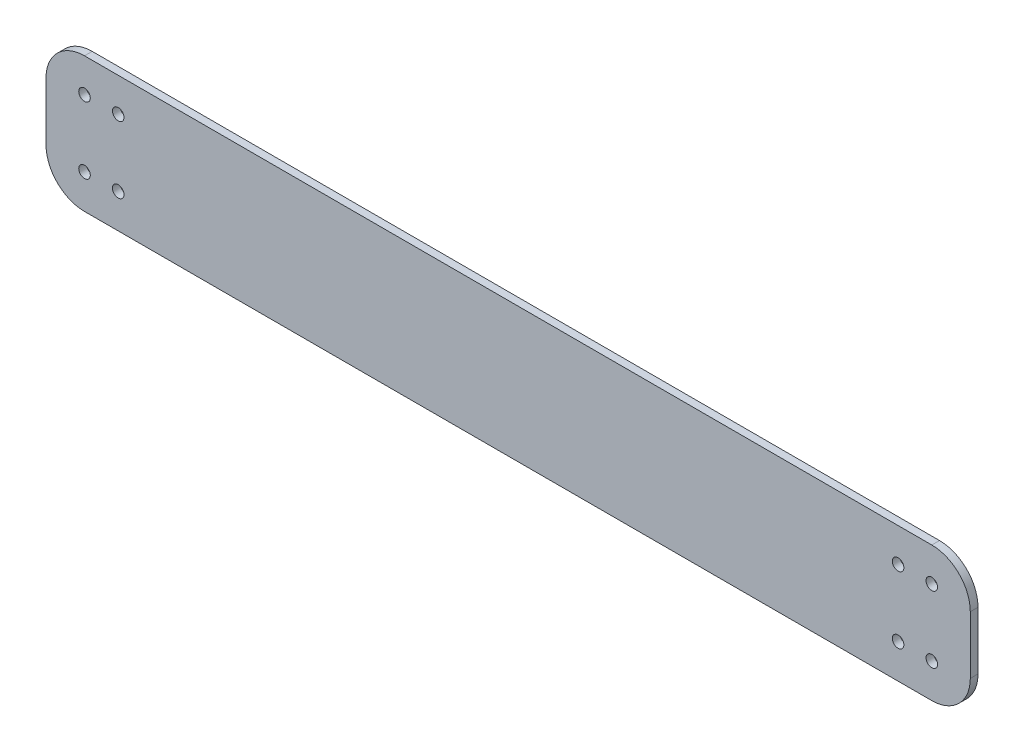
ISO-10303-21;
HEADER;
FILE_DESCRIPTION(('STEP AP214'),'2;1');
FILE_NAME('part.step','',(''),(''),'','','');
FILE_SCHEMA(('AUTOMOTIVE_DESIGN { 1 0 10303 214 1 1 1 1 }'));
ENDSEC;
DATA;
#1=APPLICATION_CONTEXT('core data for automotive mechanical design processes');
#2=APPLICATION_PROTOCOL_DEFINITION('international standard','automotive_design',2000,#1);
#3=PRODUCT_CONTEXT('',#1,'mechanical');
#4=PRODUCT('Part','Part','',(#3));
#5=PRODUCT_RELATED_PRODUCT_CATEGORY('part','',(#4));
#6=PRODUCT_DEFINITION_FORMATION('','',#4);
#7=PRODUCT_DEFINITION_CONTEXT('part definition',#1,'design');
#8=PRODUCT_DEFINITION('design','',#6,#7);
#9=PRODUCT_DEFINITION_SHAPE('','',#8);
#10=(LENGTH_UNIT() NAMED_UNIT(*) SI_UNIT(.MILLI.,.METRE.));
#11=(NAMED_UNIT(*) PLANE_ANGLE_UNIT() SI_UNIT($,.RADIAN.));
#12=(NAMED_UNIT(*) SI_UNIT($,.STERADIAN.) SOLID_ANGLE_UNIT());
#13=UNCERTAINTY_MEASURE_WITH_UNIT(LENGTH_MEASURE(1.E-05),#10,'distance_accuracy_value','');
#14=(GEOMETRIC_REPRESENTATION_CONTEXT(3) GLOBAL_UNCERTAINTY_ASSIGNED_CONTEXT((#13)) GLOBAL_UNIT_ASSIGNED_CONTEXT((#10,
#11,#12)) REPRESENTATION_CONTEXT('',''));
#15=CARTESIAN_POINT('',(0.,0.,0.));
#16=DIRECTION('',(0.,0.,1.));
#17=DIRECTION('',(1.,0.,0.));
#18=AXIS2_PLACEMENT_3D('',#15,#16,#17);
#19=CARTESIAN_POINT('',(169.639632597225,-2.6296006774803,2.));
#20=DIRECTION('',(0.,0.,-1.));
#21=DIRECTION('',(-1.,0.,0.));
#22=AXIS2_PLACEMENT_3D('',#19,#20,#21);
#23=CYLINDRICAL_SURFACE('',#22,10.);
#24=CARTESIAN_POINT('',(169.639632597225,-2.6296006774803,0.));
#25=DIRECTION('',(0.,0.,1.));
#26=DIRECTION('',(-1.,0.,0.));
#27=AXIS2_PLACEMENT_3D('',#24,#25,#26);
#28=CIRCLE('',#27,10.);
#29=CARTESIAN_POINT('',(169.639632597225,-12.6296006774803,0.));
#30=VERTEX_POINT('',#29);
#31=CARTESIAN_POINT('',(179.639632597225,-2.62960067748023,0.));
#32=VERTEX_POINT('',#31);
#33=EDGE_CURVE('E133',#30,#32,#28,.T.);
#34=ORIENTED_EDGE('',*,*,#33,.T.);
#35=DIRECTION('',(0.,0.,-1.));
#36=VECTOR('',#35,1.);
#37=CARTESIAN_POINT('',(179.639632597225,-2.62960067748023,2.));
#38=LINE('',#37,#36);
#39=CARTESIAN_POINT('',(179.639632597225,-2.62960067748023,2.));
#40=VERTEX_POINT('',#39);
#41=EDGE_CURVE('E11',#40,#32,#38,.T.);
#42=ORIENTED_EDGE('',*,*,#41,.F.);
#43=CARTESIAN_POINT('',(169.639632597225,-2.6296006774803,2.));
#44=DIRECTION('',(0.,0.,1.));
#45=DIRECTION('',(-1.,0.,0.));
#46=AXIS2_PLACEMENT_3D('',#43,#44,#45);
#47=CIRCLE('',#46,10.);
#48=CARTESIAN_POINT('',(169.639632597225,-12.6296006774803,2.));
#49=VERTEX_POINT('',#48);
#50=EDGE_CURVE('E148',#49,#40,#47,.T.);
#51=ORIENTED_EDGE('',*,*,#50,.F.);
#52=DIRECTION('',(0.,0.,-1.));
#53=VECTOR('',#52,1.);
#54=CARTESIAN_POINT('',(169.639632597225,-12.6296006774803,2.));
#55=LINE('',#54,#53);
#56=EDGE_CURVE('E129',#49,#30,#55,.T.);
#57=ORIENTED_EDGE('',*,*,#56,.T.);
#58=EDGE_LOOP('',(#34,#42,#51,#57));
#59=FACE_BOUND('',#58,.T.);
#60=ADVANCED_FACE('F37',(#59),#23,.T.);
#61=CARTESIAN_POINT('',(179.639632597225,12.3703993225196,2.));
#62=DIRECTION('',(-1.,0.,0.));
#63=DIRECTION('',(0.,0.,1.));
#64=AXIS2_PLACEMENT_3D('',#61,#62,#63);
#65=PLANE('',#64);
#66=DIRECTION('',(0.,1.,0.));
#67=VECTOR('',#66,1.);
#68=CARTESIAN_POINT('',(179.639632597225,12.3703993225196,0.));
#69=LINE('',#68,#67);
#70=CARTESIAN_POINT('',(179.639632597225,12.3703993225196,0.));
#71=VERTEX_POINT('',#70);
#72=EDGE_CURVE('E136',#32,#71,#69,.T.);
#73=ORIENTED_EDGE('',*,*,#72,.T.);
#74=DIRECTION('',(0.,0.,-1.));
#75=VECTOR('',#74,1.);
#76=CARTESIAN_POINT('',(179.639632597225,12.3703993225196,2.));
#77=LINE('',#76,#75);
#78=CARTESIAN_POINT('',(179.639632597225,12.3703993225196,2.));
#79=VERTEX_POINT('',#78);
#80=EDGE_CURVE('E45',#79,#71,#77,.T.);
#81=ORIENTED_EDGE('',*,*,#80,.F.);
#82=DIRECTION('',(0.,1.,0.));
#83=VECTOR('',#82,1.);
#84=CARTESIAN_POINT('',(179.639632597225,12.3703993225196,2.));
#85=LINE('',#84,#83);
#86=EDGE_CURVE('E96',#40,#79,#85,.T.);
#87=ORIENTED_EDGE('',*,*,#86,.F.);
#88=ORIENTED_EDGE('',*,*,#41,.T.);
#89=EDGE_LOOP('',(#73,#81,#87,#88));
#90=FACE_BOUND('',#89,.T.);
#91=ADVANCED_FACE('F262',(#90),#65,.F.);
#92=CARTESIAN_POINT('',(169.639632597225,12.3703993225197,2.));
#93=DIRECTION('',(0.,0.,-1.));
#94=DIRECTION('',(-1.,0.,0.));
#95=AXIS2_PLACEMENT_3D('',#92,#93,#94);
#96=CYLINDRICAL_SURFACE('',#95,10.);
#97=CARTESIAN_POINT('',(169.639632597225,12.3703993225197,0.));
#98=DIRECTION('',(0.,0.,1.));
#99=DIRECTION('',(-1.,0.,0.));
#100=AXIS2_PLACEMENT_3D('',#97,#98,#99);
#101=CIRCLE('',#100,10.);
#102=CARTESIAN_POINT('',(169.639632597225,22.3703993225197,0.));
#103=VERTEX_POINT('',#102);
#104=EDGE_CURVE('E139',#71,#103,#101,.T.);
#105=ORIENTED_EDGE('',*,*,#104,.T.);
#106=DIRECTION('',(0.,0.,-1.));
#107=VECTOR('',#106,1.);
#108=CARTESIAN_POINT('',(169.639632597225,22.3703993225197,2.));
#109=LINE('',#108,#107);
#110=CARTESIAN_POINT('',(169.639632597225,22.3703993225197,2.));
#111=VERTEX_POINT('',#110);
#112=EDGE_CURVE('E155',#111,#103,#109,.T.);
#113=ORIENTED_EDGE('',*,*,#112,.F.);
#114=CARTESIAN_POINT('',(169.639632597225,12.3703993225197,2.));
#115=DIRECTION('',(0.,0.,1.));
#116=DIRECTION('',(-1.,0.,0.));
#117=AXIS2_PLACEMENT_3D('',#114,#115,#116);
#118=CIRCLE('',#117,10.);
#119=EDGE_CURVE('E163',#79,#111,#118,.T.);
#120=ORIENTED_EDGE('',*,*,#119,.F.);
#121=ORIENTED_EDGE('',*,*,#80,.T.);
#122=EDGE_LOOP('',(#105,#113,#120,#121));
#123=FACE_BOUND('',#122,.T.);
#124=ADVANCED_FACE('F161',(#123),#96,.T.);
#125=CARTESIAN_POINT('',(-50.360367402775,22.3703993225197,2.));
#126=DIRECTION('',(0.,-1.,0.));
#127=DIRECTION('',(0.,0.,-1.));
#128=AXIS2_PLACEMENT_3D('',#125,#126,#127);
#129=PLANE('',#128);
#130=DIRECTION('',(-1.,0.,0.));
#131=VECTOR('',#130,1.);
#132=CARTESIAN_POINT('',(-50.360367402775,22.3703993225197,0.));
#133=LINE('',#132,#131);
#134=CARTESIAN_POINT('',(-50.360367402775,22.3703993225197,0.));
#135=VERTEX_POINT('',#134);
#136=EDGE_CURVE('E141',#103,#135,#133,.T.);
#137=ORIENTED_EDGE('',*,*,#136,.T.);
#138=DIRECTION('',(0.,0.,-1.));
#139=VECTOR('',#138,1.);
#140=CARTESIAN_POINT('',(-50.360367402775,22.3703993225197,2.));
#141=LINE('',#140,#139);
#142=CARTESIAN_POINT('',(-50.360367402775,22.3703993225197,2.));
#143=VERTEX_POINT('',#142);
#144=EDGE_CURVE('E152',#143,#135,#141,.T.);
#145=ORIENTED_EDGE('',*,*,#144,.F.);
#146=DIRECTION('',(-1.,0.,0.));
#147=VECTOR('',#146,1.);
#148=CARTESIAN_POINT('',(-50.360367402775,22.3703993225197,2.));
#149=LINE('',#148,#147);
#150=EDGE_CURVE('E175',#111,#143,#149,.T.);
#151=ORIENTED_EDGE('',*,*,#150,.F.);
#152=ORIENTED_EDGE('',*,*,#112,.T.);
#153=EDGE_LOOP('',(#137,#145,#151,#152));
#154=FACE_BOUND('',#153,.T.);
#155=ADVANCED_FACE('F171',(#154),#129,.F.);
#156=CARTESIAN_POINT('',(-50.3603674027751,12.3703993225197,2.));
#157=DIRECTION('',(0.,0.,-1.));
#158=DIRECTION('',(-1.,0.,0.));
#159=AXIS2_PLACEMENT_3D('',#156,#157,#158);
#160=CYLINDRICAL_SURFACE('',#159,10.);
#161=CARTESIAN_POINT('',(-50.3603674027751,12.3703993225197,0.));
#162=DIRECTION('',(0.,0.,1.));
#163=DIRECTION('',(1.,0.,0.));
#164=AXIS2_PLACEMENT_3D('',#161,#162,#163);
#165=CIRCLE('',#164,10.);
#166=CARTESIAN_POINT('',(-60.3603674027751,12.3703993225196,0.));
#167=VERTEX_POINT('',#166);
#168=EDGE_CURVE('E143',#135,#167,#165,.T.);
#169=ORIENTED_EDGE('',*,*,#168,.T.);
#170=DIRECTION('',(0.,0.,-1.));
#171=VECTOR('',#170,1.);
#172=CARTESIAN_POINT('',(-60.3603674027751,12.3703993225196,2.));
#173=LINE('',#172,#171);
#174=CARTESIAN_POINT('',(-60.3603674027751,12.3703993225196,2.));
#175=VERTEX_POINT('',#174);
#176=EDGE_CURVE('E124',#175,#167,#173,.T.);
#177=ORIENTED_EDGE('',*,*,#176,.F.);
#178=CARTESIAN_POINT('',(-50.3603674027751,12.3703993225197,2.));
#179=DIRECTION('',(0.,0.,1.));
#180=DIRECTION('',(1.,0.,0.));
#181=AXIS2_PLACEMENT_3D('',#178,#179,#180);
#182=CIRCLE('',#181,10.);
#183=EDGE_CURVE('E115',#143,#175,#182,.T.);
#184=ORIENTED_EDGE('',*,*,#183,.F.);
#185=ORIENTED_EDGE('',*,*,#144,.T.);
#186=EDGE_LOOP('',(#169,#177,#184,#185));
#187=FACE_BOUND('',#186,.T.);
#188=ADVANCED_FACE('F174',(#187),#160,.T.);
#189=CARTESIAN_POINT('',(-60.3603674027751,-2.62960067748023,2.));
#190=DIRECTION('',(1.,0.,0.));
#191=DIRECTION('',(0.,0.,-1.));
#192=AXIS2_PLACEMENT_3D('',#189,#190,#191);
#193=PLANE('',#192);
#194=DIRECTION('',(0.,-1.,0.));
#195=VECTOR('',#194,1.);
#196=CARTESIAN_POINT('',(-60.3603674027751,-2.62960067748023,0.));
#197=LINE('',#196,#195);
#198=CARTESIAN_POINT('',(-60.3603674027751,-2.62960067748023,0.));
#199=VERTEX_POINT('',#198);
#200=EDGE_CURVE('E123',#167,#199,#197,.T.);
#201=ORIENTED_EDGE('',*,*,#200,.T.);
#202=DIRECTION('',(0.,0.,-1.));
#203=VECTOR('',#202,1.);
#204=CARTESIAN_POINT('',(-60.3603674027751,-2.62960067748023,2.));
#205=LINE('',#204,#203);
#206=CARTESIAN_POINT('',(-60.3603674027751,-2.62960067748023,2.));
#207=VERTEX_POINT('',#206);
#208=EDGE_CURVE('E120',#207,#199,#205,.T.);
#209=ORIENTED_EDGE('',*,*,#208,.F.);
#210=DIRECTION('',(0.,-1.,0.));
#211=VECTOR('',#210,1.);
#212=CARTESIAN_POINT('',(-60.3603674027751,-2.62960067748023,2.));
#213=LINE('',#212,#211);
#214=EDGE_CURVE('E109',#175,#207,#213,.T.);
#215=ORIENTED_EDGE('',*,*,#214,.F.);
#216=ORIENTED_EDGE('',*,*,#176,.T.);
#217=EDGE_LOOP('',(#201,#209,#215,#216));
#218=FACE_BOUND('',#217,.T.);
#219=ADVANCED_FACE('F121',(#218),#193,.F.);
#220=CARTESIAN_POINT('',(-50.3603674027751,-2.6296006774803,2.));
#221=DIRECTION('',(0.,0.,-1.));
#222=DIRECTION('',(-1.,0.,0.));
#223=AXIS2_PLACEMENT_3D('',#220,#221,#222);
#224=CYLINDRICAL_SURFACE('',#223,10.);
#225=CARTESIAN_POINT('',(-50.3603674027751,-2.6296006774803,0.));
#226=DIRECTION('',(0.,0.,1.));
#227=DIRECTION('',(-1.,0.,0.));
#228=AXIS2_PLACEMENT_3D('',#225,#226,#227);
#229=CIRCLE('',#228,10.);
#230=CARTESIAN_POINT('',(-50.360367402775,-12.6296006774803,0.));
#231=VERTEX_POINT('',#230);
#232=EDGE_CURVE('E82',#199,#231,#229,.T.);
#233=ORIENTED_EDGE('',*,*,#232,.T.);
#234=DIRECTION('',(0.,0.,-1.));
#235=VECTOR('',#234,1.);
#236=CARTESIAN_POINT('',(-50.360367402775,-12.6296006774803,2.));
#237=LINE('',#236,#235);
#238=CARTESIAN_POINT('',(-50.360367402775,-12.6296006774803,2.));
#239=VERTEX_POINT('',#238);
#240=EDGE_CURVE('E125',#239,#231,#237,.T.);
#241=ORIENTED_EDGE('',*,*,#240,.F.);
#242=CARTESIAN_POINT('',(-50.3603674027751,-2.6296006774803,2.));
#243=DIRECTION('',(0.,0.,1.));
#244=DIRECTION('',(-1.,0.,0.));
#245=AXIS2_PLACEMENT_3D('',#242,#243,#244);
#246=CIRCLE('',#245,10.);
#247=EDGE_CURVE('E113',#207,#239,#246,.T.);
#248=ORIENTED_EDGE('',*,*,#247,.F.);
#249=ORIENTED_EDGE('',*,*,#208,.T.);
#250=EDGE_LOOP('',(#233,#241,#248,#249));
#251=FACE_BOUND('',#250,.T.);
#252=ADVANCED_FACE('F127',(#251),#224,.T.);
#253=CARTESIAN_POINT('',(169.639632597225,-12.6296006774803,2.));
#254=DIRECTION('',(0.,1.,0.));
#255=DIRECTION('',(0.,0.,1.));
#256=AXIS2_PLACEMENT_3D('',#253,#254,#255);
#257=PLANE('',#256);
#258=DIRECTION('',(1.,0.,0.));
#259=VECTOR('',#258,1.);
#260=CARTESIAN_POINT('',(169.639632597225,-12.6296006774803,0.));
#261=LINE('',#260,#259);
#262=EDGE_CURVE('E88',#231,#30,#261,.T.);
#263=ORIENTED_EDGE('',*,*,#262,.T.);
#264=ORIENTED_EDGE('',*,*,#56,.F.);
#265=DIRECTION('',(1.,0.,0.));
#266=VECTOR('',#265,1.);
#267=CARTESIAN_POINT('',(169.639632597225,-12.6296006774803,2.));
#268=LINE('',#267,#266);
#269=EDGE_CURVE('E53',#239,#49,#268,.T.);
#270=ORIENTED_EDGE('',*,*,#269,.F.);
#271=ORIENTED_EDGE('',*,*,#240,.T.);
#272=EDGE_LOOP('',(#263,#264,#270,#271));
#273=FACE_BOUND('',#272,.T.);
#274=ADVANCED_FACE('F269',(#273),#257,.F.);
#275=CARTESIAN_POINT('',(169.639632597225,-2.6296006774803,2.));
#276=DIRECTION('',(0.,0.,-1.));
#277=DIRECTION('',(-1.,0.,0.));
#278=AXIS2_PLACEMENT_3D('',#275,#276,#277);
#279=PLANE('',#278);
#280=CARTESIAN_POINT('',(169.639632597225,13.6203993225198,2.));
#281=DIRECTION('',(0.,0.,-1.));
#282=DIRECTION('',(-1.,0.,0.));
#283=AXIS2_PLACEMENT_3D('',#280,#281,#282);
#284=CIRCLE('',#283,1.5);
#285=CARTESIAN_POINT('',(168.139632597225,13.6203993225198,2.));
#286=VERTEX_POINT('',#285);
#287=EDGE_CURVE('E222',#286,#286,#284,.T.);
#288=ORIENTED_EDGE('',*,*,#287,.T.);
#289=EDGE_LOOP('',(#288));
#290=FACE_BOUND('',#289,.T.);
#291=CARTESIAN_POINT('',(160.889632597225,13.6203993225198,2.));
#292=DIRECTION('',(0.,0.,-1.));
#293=DIRECTION('',(-1.,0.,0.));
#294=AXIS2_PLACEMENT_3D('',#291,#292,#293);
#295=CIRCLE('',#294,1.5);
#296=CARTESIAN_POINT('',(159.389632597225,13.6203993225198,2.));
#297=VERTEX_POINT('',#296);
#298=EDGE_CURVE('E216',#297,#297,#295,.T.);
#299=ORIENTED_EDGE('',*,*,#298,.T.);
#300=EDGE_LOOP('',(#299));
#301=FACE_BOUND('',#300,.T.);
#302=CARTESIAN_POINT('',(160.889632597225,-3.73217799081896,2.));
#303=DIRECTION('',(0.,0.,-1.));
#304=DIRECTION('',(-1.,0.,0.));
#305=AXIS2_PLACEMENT_3D('',#302,#303,#304);
#306=CIRCLE('',#305,1.5);
#307=CARTESIAN_POINT('',(159.389632597225,-3.73217799081896,2.));
#308=VERTEX_POINT('',#307);
#309=EDGE_CURVE('E210',#308,#308,#306,.T.);
#310=ORIENTED_EDGE('',*,*,#309,.T.);
#311=EDGE_LOOP('',(#310));
#312=FACE_BOUND('',#311,.T.);
#313=CARTESIAN_POINT('',(169.639632597225,-3.73217799081895,2.));
#314=DIRECTION('',(0.,0.,-1.));
#315=DIRECTION('',(-1.,0.,0.));
#316=AXIS2_PLACEMENT_3D('',#313,#314,#315);
#317=CIRCLE('',#316,1.5);
#318=CARTESIAN_POINT('',(168.139632597225,-3.73217799081895,2.));
#319=VERTEX_POINT('',#318);
#320=EDGE_CURVE('E204',#319,#319,#317,.T.);
#321=ORIENTED_EDGE('',*,*,#320,.T.);
#322=EDGE_LOOP('',(#321));
#323=FACE_BOUND('',#322,.T.);
#324=CARTESIAN_POINT('',(-41.610367402775,13.6203993225197,2.));
#325=DIRECTION('',(0.,0.,-1.));
#326=DIRECTION('',(-1.,0.,0.));
#327=AXIS2_PLACEMENT_3D('',#324,#325,#326);
#328=CIRCLE('',#327,1.5);
#329=CARTESIAN_POINT('',(-43.110367402775,13.6203993225197,2.));
#330=VERTEX_POINT('',#329);
#331=EDGE_CURVE('E198',#330,#330,#328,.T.);
#332=ORIENTED_EDGE('',*,*,#331,.T.);
#333=EDGE_LOOP('',(#332));
#334=FACE_BOUND('',#333,.T.);
#335=CARTESIAN_POINT('',(-50.360367402775,13.6203993225197,2.));
#336=DIRECTION('',(0.,0.,-1.));
#337=DIRECTION('',(-1.,0.,0.));
#338=AXIS2_PLACEMENT_3D('',#335,#336,#337);
#339=CIRCLE('',#338,1.5);
#340=CARTESIAN_POINT('',(-51.860367402775,13.6203993225197,2.));
#341=VERTEX_POINT('',#340);
#342=EDGE_CURVE('E192',#341,#341,#339,.T.);
#343=ORIENTED_EDGE('',*,*,#342,.T.);
#344=EDGE_LOOP('',(#343));
#345=FACE_BOUND('',#344,.T.);
#346=CARTESIAN_POINT('',(-41.610367402775,-3.73217799081904,2.));
#347=DIRECTION('',(0.,0.,-1.));
#348=DIRECTION('',(-1.,0.,0.));
#349=AXIS2_PLACEMENT_3D('',#346,#347,#348);
#350=CIRCLE('',#349,1.5);
#351=CARTESIAN_POINT('',(-43.110367402775,-3.73217799081904,2.));
#352=VERTEX_POINT('',#351);
#353=EDGE_CURVE('E186',#352,#352,#350,.T.);
#354=ORIENTED_EDGE('',*,*,#353,.T.);
#355=EDGE_LOOP('',(#354));
#356=FACE_BOUND('',#355,.T.);
#357=CARTESIAN_POINT('',(-50.360367402775,-3.73217799081904,2.));
#358=DIRECTION('',(0.,0.,-1.));
#359=DIRECTION('',(-1.,0.,0.));
#360=AXIS2_PLACEMENT_3D('',#357,#358,#359);
#361=CIRCLE('',#360,1.5);
#362=CARTESIAN_POINT('',(-51.860367402775,-3.73217799081904,2.));
#363=VERTEX_POINT('',#362);
#364=EDGE_CURVE('E137',#363,#363,#361,.T.);
#365=ORIENTED_EDGE('',*,*,#364,.T.);
#366=EDGE_LOOP('',(#365));
#367=FACE_BOUND('',#366,.T.);
#368=ORIENTED_EDGE('',*,*,#50,.T.);
#369=ORIENTED_EDGE('',*,*,#86,.T.);
#370=ORIENTED_EDGE('',*,*,#119,.T.);
#371=ORIENTED_EDGE('',*,*,#150,.T.);
#372=ORIENTED_EDGE('',*,*,#183,.T.);
#373=ORIENTED_EDGE('',*,*,#214,.T.);
#374=ORIENTED_EDGE('',*,*,#247,.T.);
#375=ORIENTED_EDGE('',*,*,#269,.T.);
#376=EDGE_LOOP('',(#368,#369,#370,#371,#372,#373,#374,#375));
#377=FACE_BOUND('',#376,.T.);
#378=ADVANCED_FACE('F111',(#290,#301,#312,#323,#334,#345,#356,#367,#377),#279,.F.);
#379=CARTESIAN_POINT('',(169.639632597225,-2.6296006774803,0.));
#380=DIRECTION('',(0.,0.,-1.));
#381=DIRECTION('',(-1.,0.,0.));
#382=AXIS2_PLACEMENT_3D('',#379,#380,#381);
#383=PLANE('',#382);
#384=CARTESIAN_POINT('',(169.639632597225,13.6203993225198,0.));
#385=DIRECTION('',(0.,0.,-1.));
#386=DIRECTION('',(-1.,0.,0.));
#387=AXIS2_PLACEMENT_3D('',#384,#385,#386);
#388=CIRCLE('',#387,1.5);
#389=CARTESIAN_POINT('',(168.139632597225,13.6203993225198,0.));
#390=VERTEX_POINT('',#389);
#391=EDGE_CURVE('E225',#390,#390,#388,.T.);
#392=ORIENTED_EDGE('',*,*,#391,.F.);
#393=EDGE_LOOP('',(#392));
#394=FACE_BOUND('',#393,.T.);
#395=CARTESIAN_POINT('',(160.889632597225,13.6203993225198,0.));
#396=DIRECTION('',(0.,0.,-1.));
#397=DIRECTION('',(-1.,0.,0.));
#398=AXIS2_PLACEMENT_3D('',#395,#396,#397);
#399=CIRCLE('',#398,1.49999999999997);
#400=CARTESIAN_POINT('',(159.389632597225,13.6203993225198,0.));
#401=VERTEX_POINT('',#400);
#402=EDGE_CURVE('E219',#401,#401,#399,.T.);
#403=ORIENTED_EDGE('',*,*,#402,.F.);
#404=EDGE_LOOP('',(#403));
#405=FACE_BOUND('',#404,.T.);
#406=CARTESIAN_POINT('',(160.889632597225,-3.73217799081896,0.));
#407=DIRECTION('',(0.,0.,-1.));
#408=DIRECTION('',(-1.,0.,0.));
#409=AXIS2_PLACEMENT_3D('',#406,#407,#408);
#410=CIRCLE('',#409,1.5);
#411=CARTESIAN_POINT('',(159.389632597225,-3.73217799081896,0.));
#412=VERTEX_POINT('',#411);
#413=EDGE_CURVE('E213',#412,#412,#410,.T.);
#414=ORIENTED_EDGE('',*,*,#413,.F.);
#415=EDGE_LOOP('',(#414));
#416=FACE_BOUND('',#415,.T.);
#417=CARTESIAN_POINT('',(169.639632597225,-3.73217799081895,0.));
#418=DIRECTION('',(0.,0.,-1.));
#419=DIRECTION('',(-1.,0.,0.));
#420=AXIS2_PLACEMENT_3D('',#417,#418,#419);
#421=CIRCLE('',#420,1.49999999999997);
#422=CARTESIAN_POINT('',(168.139632597225,-3.73217799081895,0.));
#423=VERTEX_POINT('',#422);
#424=EDGE_CURVE('E207',#423,#423,#421,.T.);
#425=ORIENTED_EDGE('',*,*,#424,.F.);
#426=EDGE_LOOP('',(#425));
#427=FACE_BOUND('',#426,.T.);
#428=CARTESIAN_POINT('',(-41.610367402775,13.6203993225197,0.));
#429=DIRECTION('',(0.,0.,-1.));
#430=DIRECTION('',(-1.,0.,0.));
#431=AXIS2_PLACEMENT_3D('',#428,#429,#430);
#432=CIRCLE('',#431,1.5);
#433=CARTESIAN_POINT('',(-43.110367402775,13.6203993225197,0.));
#434=VERTEX_POINT('',#433);
#435=EDGE_CURVE('E201',#434,#434,#432,.T.);
#436=ORIENTED_EDGE('',*,*,#435,.F.);
#437=EDGE_LOOP('',(#436));
#438=FACE_BOUND('',#437,.T.);
#439=CARTESIAN_POINT('',(-50.360367402775,13.6203993225197,0.));
#440=DIRECTION('',(0.,0.,-1.));
#441=DIRECTION('',(-1.,0.,0.));
#442=AXIS2_PLACEMENT_3D('',#439,#440,#441);
#443=CIRCLE('',#442,1.5);
#444=CARTESIAN_POINT('',(-51.860367402775,13.6203993225197,0.));
#445=VERTEX_POINT('',#444);
#446=EDGE_CURVE('E195',#445,#445,#443,.T.);
#447=ORIENTED_EDGE('',*,*,#446,.F.);
#448=EDGE_LOOP('',(#447));
#449=FACE_BOUND('',#448,.T.);
#450=CARTESIAN_POINT('',(-41.610367402775,-3.73217799081904,0.));
#451=DIRECTION('',(0.,0.,-1.));
#452=DIRECTION('',(-1.,0.,0.));
#453=AXIS2_PLACEMENT_3D('',#450,#451,#452);
#454=CIRCLE('',#453,1.5);
#455=CARTESIAN_POINT('',(-43.110367402775,-3.73217799081904,0.));
#456=VERTEX_POINT('',#455);
#457=EDGE_CURVE('E189',#456,#456,#454,.T.);
#458=ORIENTED_EDGE('',*,*,#457,.F.);
#459=EDGE_LOOP('',(#458));
#460=FACE_BOUND('',#459,.T.);
#461=CARTESIAN_POINT('',(-50.360367402775,-3.73217799081904,0.));
#462=DIRECTION('',(0.,0.,-1.));
#463=DIRECTION('',(-1.,0.,0.));
#464=AXIS2_PLACEMENT_3D('',#461,#462,#463);
#465=CIRCLE('',#464,1.5);
#466=CARTESIAN_POINT('',(-51.860367402775,-3.73217799081904,0.));
#467=VERTEX_POINT('',#466);
#468=EDGE_CURVE('E183',#467,#467,#465,.T.);
#469=ORIENTED_EDGE('',*,*,#468,.F.);
#470=EDGE_LOOP('',(#469));
#471=FACE_BOUND('',#470,.T.);
#472=ORIENTED_EDGE('',*,*,#33,.F.);
#473=ORIENTED_EDGE('',*,*,#262,.F.);
#474=ORIENTED_EDGE('',*,*,#232,.F.);
#475=ORIENTED_EDGE('',*,*,#200,.F.);
#476=ORIENTED_EDGE('',*,*,#168,.F.);
#477=ORIENTED_EDGE('',*,*,#136,.F.);
#478=ORIENTED_EDGE('',*,*,#104,.F.);
#479=ORIENTED_EDGE('',*,*,#72,.F.);
#480=EDGE_LOOP('',(#472,#473,#474,#475,#476,#477,#478,#479));
#481=FACE_BOUND('',#480,.T.);
#482=ADVANCED_FACE('F167',(#394,#405,#416,#427,#438,#449,#460,#471,#481),#383,.T.);
#483=CARTESIAN_POINT('',(-50.360367402775,-3.73217799081904,0.));
#484=DIRECTION('',(0.,0.,-1.));
#485=DIRECTION('',(-1.,0.,0.));
#486=AXIS2_PLACEMENT_3D('',#483,#484,#485);
#487=CYLINDRICAL_SURFACE('',#486,1.5);
#488=ORIENTED_EDGE('',*,*,#364,.F.);
#489=EDGE_LOOP('',(#488));
#490=FACE_BOUND('',#489,.T.);
#491=ORIENTED_EDGE('',*,*,#468,.T.);
#492=EDGE_LOOP('',(#491));
#493=FACE_BOUND('',#492,.T.);
#494=ADVANCED_FACE('F233',(#490,#493),#487,.F.);
#495=CARTESIAN_POINT('',(-41.610367402775,-3.73217799081904,0.));
#496=DIRECTION('',(0.,0.,-1.));
#497=DIRECTION('',(-1.,0.,0.));
#498=AXIS2_PLACEMENT_3D('',#495,#496,#497);
#499=CYLINDRICAL_SURFACE('',#498,1.5);
#500=ORIENTED_EDGE('',*,*,#353,.F.);
#501=EDGE_LOOP('',(#500));
#502=FACE_BOUND('',#501,.T.);
#503=ORIENTED_EDGE('',*,*,#457,.T.);
#504=EDGE_LOOP('',(#503));
#505=FACE_BOUND('',#504,.T.);
#506=ADVANCED_FACE('F250',(#502,#505),#499,.F.);
#507=CARTESIAN_POINT('',(-50.360367402775,13.6203993225197,0.));
#508=DIRECTION('',(0.,0.,-1.));
#509=DIRECTION('',(-1.,0.,0.));
#510=AXIS2_PLACEMENT_3D('',#507,#508,#509);
#511=CYLINDRICAL_SURFACE('',#510,1.5);
#512=ORIENTED_EDGE('',*,*,#342,.F.);
#513=EDGE_LOOP('',(#512));
#514=FACE_BOUND('',#513,.T.);
#515=ORIENTED_EDGE('',*,*,#446,.T.);
#516=EDGE_LOOP('',(#515));
#517=FACE_BOUND('',#516,.T.);
#518=ADVANCED_FACE('F256',(#514,#517),#511,.F.);
#519=CARTESIAN_POINT('',(-41.610367402775,13.6203993225197,0.));
#520=DIRECTION('',(0.,0.,-1.));
#521=DIRECTION('',(-1.,0.,0.));
#522=AXIS2_PLACEMENT_3D('',#519,#520,#521);
#523=CYLINDRICAL_SURFACE('',#522,1.5);
#524=ORIENTED_EDGE('',*,*,#331,.F.);
#525=EDGE_LOOP('',(#524));
#526=FACE_BOUND('',#525,.T.);
#527=ORIENTED_EDGE('',*,*,#435,.T.);
#528=EDGE_LOOP('',(#527));
#529=FACE_BOUND('',#528,.T.);
#530=ADVANCED_FACE('F331',(#526,#529),#523,.F.);
#531=CARTESIAN_POINT('',(169.639632597225,-3.73217799081895,0.));
#532=DIRECTION('',(0.,0.,-1.));
#533=DIRECTION('',(-1.,0.,0.));
#534=AXIS2_PLACEMENT_3D('',#531,#532,#533);
#535=CYLINDRICAL_SURFACE('',#534,1.49999999999999);
#536=ORIENTED_EDGE('',*,*,#320,.F.);
#537=EDGE_LOOP('',(#536));
#538=FACE_BOUND('',#537,.T.);
#539=ORIENTED_EDGE('',*,*,#424,.T.);
#540=EDGE_LOOP('',(#539));
#541=FACE_BOUND('',#540,.T.);
#542=ADVANCED_FACE('F341',(#538,#541),#535,.F.);
#543=CARTESIAN_POINT('',(160.889632597225,-3.73217799081896,0.));
#544=DIRECTION('',(0.,0.,-1.));
#545=DIRECTION('',(-1.,0.,0.));
#546=AXIS2_PLACEMENT_3D('',#543,#544,#545);
#547=CYLINDRICAL_SURFACE('',#546,1.5);
#548=ORIENTED_EDGE('',*,*,#309,.F.);
#549=EDGE_LOOP('',(#548));
#550=FACE_BOUND('',#549,.T.);
#551=ORIENTED_EDGE('',*,*,#413,.T.);
#552=EDGE_LOOP('',(#551));
#553=FACE_BOUND('',#552,.T.);
#554=ADVANCED_FACE('F361',(#550,#553),#547,.F.);
#555=CARTESIAN_POINT('',(160.889632597225,13.6203993225198,0.));
#556=DIRECTION('',(0.,0.,-1.));
#557=DIRECTION('',(-1.,0.,0.));
#558=AXIS2_PLACEMENT_3D('',#555,#556,#557);
#559=CYLINDRICAL_SURFACE('',#558,1.49999999999999);
#560=ORIENTED_EDGE('',*,*,#298,.F.);
#561=EDGE_LOOP('',(#560));
#562=FACE_BOUND('',#561,.T.);
#563=ORIENTED_EDGE('',*,*,#402,.T.);
#564=EDGE_LOOP('',(#563));
#565=FACE_BOUND('',#564,.T.);
#566=ADVANCED_FACE('F371',(#562,#565),#559,.F.);
#567=CARTESIAN_POINT('',(169.639632597225,13.6203993225198,0.));
#568=DIRECTION('',(0.,0.,-1.));
#569=DIRECTION('',(-1.,0.,0.));
#570=AXIS2_PLACEMENT_3D('',#567,#568,#569);
#571=CYLINDRICAL_SURFACE('',#570,1.5);
#572=ORIENTED_EDGE('',*,*,#287,.F.);
#573=EDGE_LOOP('',(#572));
#574=FACE_BOUND('',#573,.T.);
#575=ORIENTED_EDGE('',*,*,#391,.T.);
#576=EDGE_LOOP('',(#575));
#577=FACE_BOUND('',#576,.T.);
#578=ADVANCED_FACE('F229',(#574,#577),#571,.F.);
#579=CLOSED_SHELL('',(#60,#91,#124,#155,#188,#219,#252,#274,#378,#482,#494,#506,#518,#530,#542,
#554,#566,#578));
#580=MANIFOLD_SOLID_BREP('B2',#579);
#581=ADVANCED_BREP_SHAPE_REPRESENTATION('',(#18,#580),#14);
#582=SHAPE_DEFINITION_REPRESENTATION(#9,#581);
ENDSEC;
END-ISO-10303-21;
